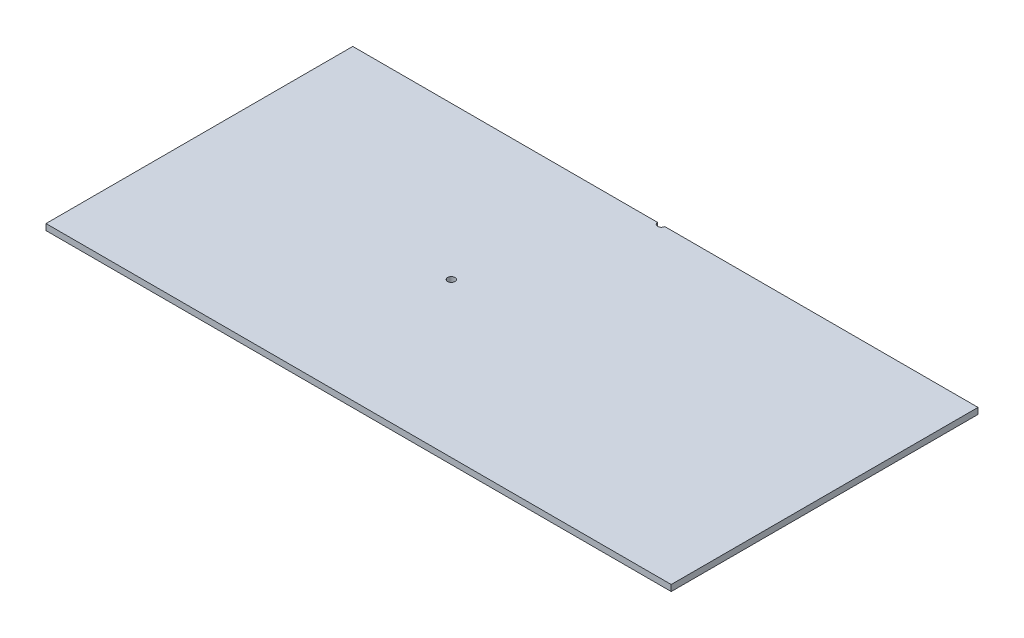
ISO-10303-21;
HEADER;
FILE_DESCRIPTION(('STEP AP214'),'2;1');
FILE_NAME('part.step','',(''),(''),'','','');
FILE_SCHEMA(('AUTOMOTIVE_DESIGN { 1 0 10303 214 1 1 1 1 }'));
ENDSEC;
DATA;
#1=APPLICATION_CONTEXT('core data for automotive mechanical design processes');
#2=APPLICATION_PROTOCOL_DEFINITION('international standard','automotive_design',2000,#1);
#3=PRODUCT_CONTEXT('',#1,'mechanical');
#4=PRODUCT('Part','Part','',(#3));
#5=PRODUCT_RELATED_PRODUCT_CATEGORY('part','',(#4));
#6=PRODUCT_DEFINITION_FORMATION('','',#4);
#7=PRODUCT_DEFINITION_CONTEXT('part definition',#1,'design');
#8=PRODUCT_DEFINITION('design','',#6,#7);
#9=PRODUCT_DEFINITION_SHAPE('','',#8);
#10=(LENGTH_UNIT() NAMED_UNIT(*) SI_UNIT(.MILLI.,.METRE.));
#11=(NAMED_UNIT(*) PLANE_ANGLE_UNIT() SI_UNIT($,.RADIAN.));
#12=(NAMED_UNIT(*) SI_UNIT($,.STERADIAN.) SOLID_ANGLE_UNIT());
#13=UNCERTAINTY_MEASURE_WITH_UNIT(LENGTH_MEASURE(1.E-05),#10,'distance_accuracy_value','');
#14=(GEOMETRIC_REPRESENTATION_CONTEXT(3) GLOBAL_UNCERTAINTY_ASSIGNED_CONTEXT((#13)) GLOBAL_UNIT_ASSIGNED_CONTEXT((#10,
#11,#12)) REPRESENTATION_CONTEXT('',''));
#15=CARTESIAN_POINT('',(0.,0.,0.));
#16=DIRECTION('',(0.,0.,1.));
#17=DIRECTION('',(1.,0.,0.));
#18=AXIS2_PLACEMENT_3D('',#15,#16,#17);
#19=CARTESIAN_POINT('',(-117.712500067131,2.54,-60.0611811366151));
#20=DIRECTION('',(0.,0.,1.));
#21=DIRECTION('',(1.,0.,0.));
#22=AXIS2_PLACEMENT_3D('',#19,#20,#21);
#23=PLANE('',#22);
#24=DIRECTION('',(-1.,0.,0.));
#25=VECTOR('',#24,1.);
#26=CARTESIAN_POINT('',(-117.712500067131,2.54,-60.0611811366151));
#27=LINE('',#26,#25);
#28=CARTESIAN_POINT('',(8.24230103203622,2.54,-60.0611811366151));
#29=VERTEX_POINT('',#28);
#30=CARTESIAN_POINT('',(-117.712500067131,2.54,-60.0611811366151));
#31=VERTEX_POINT('',#30);
#32=EDGE_CURVE('E55',#29,#31,#27,.T.);
#33=ORIENTED_EDGE('',*,*,#32,.F.);
#34=DIRECTION('',(0.,-1.,0.));
#35=VECTOR('',#34,1.);
#36=CARTESIAN_POINT('',(8.24230103203622,0.,-60.0611811366151));
#37=LINE('',#36,#35);
#38=CARTESIAN_POINT('',(8.24230103203621,0.,-60.0611811366151));
#39=VERTEX_POINT('',#38);
#40=EDGE_CURVE('E93',#29,#39,#37,.T.);
#41=ORIENTED_EDGE('',*,*,#40,.T.);
#42=DIRECTION('',(-1.,0.,0.));
#43=VECTOR('',#42,1.);
#44=CARTESIAN_POINT('',(-117.712500067131,0.,-60.0611811366151));
#45=LINE('',#44,#43);
#46=CARTESIAN_POINT('',(-117.712500067131,0.,-60.0611811366151));
#47=VERTEX_POINT('',#46);
#48=EDGE_CURVE('E77',#39,#47,#45,.T.);
#49=ORIENTED_EDGE('',*,*,#48,.T.);
#50=DIRECTION('',(0.,-1.,0.));
#51=VECTOR('',#50,1.);
#52=CARTESIAN_POINT('',(-117.712500067131,2.54,-60.0611811366151));
#53=LINE('',#52,#51);
#54=EDGE_CURVE('E113',#31,#47,#53,.T.);
#55=ORIENTED_EDGE('',*,*,#54,.F.);
#56=EDGE_LOOP('',(#33,#41,#49,#55));
#57=FACE_BOUND('',#56,.T.);
#58=ADVANCED_FACE('F30',(#57),#23,.F.);
#59=CARTESIAN_POINT('',(-117.712500067131,2.54,-60.0611811366151));
#60=DIRECTION('',(1.,0.,0.));
#61=DIRECTION('',(0.,0.,-1.));
#62=AXIS2_PLACEMENT_3D('',#59,#60,#61);
#63=PLANE('',#62);
#64=DIRECTION('',(0.,0.,1.));
#65=VECTOR('',#64,1.);
#66=CARTESIAN_POINT('',(-117.712500067131,0.,-60.0611811366151));
#67=LINE('',#66,#65);
#68=CARTESIAN_POINT('',(-117.712500067131,0.,66.7346457073501));
#69=VERTEX_POINT('',#68);
#70=EDGE_CURVE('E104',#47,#69,#67,.T.);
#71=ORIENTED_EDGE('',*,*,#70,.T.);
#72=DIRECTION('',(0.,-1.,0.));
#73=VECTOR('',#72,1.);
#74=CARTESIAN_POINT('',(-117.712500067131,2.54,66.7346457073501));
#75=LINE('',#74,#73);
#76=CARTESIAN_POINT('',(-117.712500067131,2.54,66.7346457073501));
#77=VERTEX_POINT('',#76);
#78=EDGE_CURVE('E11',#77,#69,#75,.T.);
#79=ORIENTED_EDGE('',*,*,#78,.F.);
#80=DIRECTION('',(0.,0.,1.));
#81=VECTOR('',#80,1.);
#82=CARTESIAN_POINT('',(-117.712500067131,2.54,-60.0611811366151));
#83=LINE('',#82,#81);
#84=EDGE_CURVE('E108',#31,#77,#83,.T.);
#85=ORIENTED_EDGE('',*,*,#84,.F.);
#86=ORIENTED_EDGE('',*,*,#54,.T.);
#87=EDGE_LOOP('',(#71,#79,#85,#86));
#88=FACE_BOUND('',#87,.T.);
#89=ADVANCED_FACE('F32',(#88),#63,.F.);
#90=CARTESIAN_POINT('',(-117.712500067131,2.54,66.7346457073501));
#91=DIRECTION('',(0.,0.,-1.));
#92=DIRECTION('',(-1.,0.,0.));
#93=AXIS2_PLACEMENT_3D('',#90,#91,#92);
#94=PLANE('',#93);
#95=DIRECTION('',(1.,0.,0.));
#96=VECTOR('',#95,1.);
#97=CARTESIAN_POINT('',(-117.712500067131,0.,66.7346457073501));
#98=LINE('',#97,#96);
#99=CARTESIAN_POINT('',(140.698878032996,0.,66.7346457073501));
#100=VERTEX_POINT('',#99);
#101=EDGE_CURVE('E109',#69,#100,#98,.T.);
#102=ORIENTED_EDGE('',*,*,#101,.T.);
#103=DIRECTION('',(0.,-1.,0.));
#104=VECTOR('',#103,1.);
#105=CARTESIAN_POINT('',(140.698878032996,2.54,66.7346457073501));
#106=LINE('',#105,#104);
#107=CARTESIAN_POINT('',(140.698878032996,2.54,66.7346457073501));
#108=VERTEX_POINT('',#107);
#109=EDGE_CURVE('E39',#108,#100,#106,.T.);
#110=ORIENTED_EDGE('',*,*,#109,.F.);
#111=DIRECTION('',(1.,0.,0.));
#112=VECTOR('',#111,1.);
#113=CARTESIAN_POINT('',(-117.712500067131,2.54,66.7346457073501));
#114=LINE('',#113,#112);
#115=EDGE_CURVE('E84',#77,#108,#114,.T.);
#116=ORIENTED_EDGE('',*,*,#115,.F.);
#117=ORIENTED_EDGE('',*,*,#78,.T.);
#118=EDGE_LOOP('',(#102,#110,#116,#117));
#119=FACE_BOUND('',#118,.T.);
#120=ADVANCED_FACE('F134',(#119),#94,.F.);
#121=CARTESIAN_POINT('',(140.698878032996,2.54,-60.0611811366151));
#122=DIRECTION('',(-1.,0.,0.));
#123=DIRECTION('',(0.,0.,1.));
#124=AXIS2_PLACEMENT_3D('',#121,#122,#123);
#125=PLANE('',#124);
#126=DIRECTION('',(0.,0.,-1.));
#127=VECTOR('',#126,1.);
#128=CARTESIAN_POINT('',(140.698878032996,0.,-60.0611811366151));
#129=LINE('',#128,#127);
#130=CARTESIAN_POINT('',(140.698878032996,0.,-60.0611811366151));
#131=VERTEX_POINT('',#130);
#132=EDGE_CURVE('E106',#100,#131,#129,.T.);
#133=ORIENTED_EDGE('',*,*,#132,.T.);
#134=DIRECTION('',(0.,-1.,0.));
#135=VECTOR('',#134,1.);
#136=CARTESIAN_POINT('',(140.698878032996,2.54,-60.0611811366151));
#137=LINE('',#136,#135);
#138=CARTESIAN_POINT('',(140.698878032996,2.54,-60.0611811366151));
#139=VERTEX_POINT('',#138);
#140=EDGE_CURVE('E115',#139,#131,#137,.T.);
#141=ORIENTED_EDGE('',*,*,#140,.F.);
#142=DIRECTION('',(0.,0.,-1.));
#143=VECTOR('',#142,1.);
#144=CARTESIAN_POINT('',(140.698878032996,2.54,-60.0611811366151));
#145=LINE('',#144,#143);
#146=EDGE_CURVE('E125',#108,#139,#145,.T.);
#147=ORIENTED_EDGE('',*,*,#146,.F.);
#148=ORIENTED_EDGE('',*,*,#109,.T.);
#149=EDGE_LOOP('',(#133,#141,#147,#148));
#150=FACE_BOUND('',#149,.T.);
#151=ADVANCED_FACE('F123',(#150),#125,.F.);
#152=CARTESIAN_POINT('',(11.2385970441701,0.,-60.0611811366151));
#153=VERTEX_POINT('',#152);
#154=EDGE_CURVE('E105',#131,#153,#45,.T.);
#155=ORIENTED_EDGE('',*,*,#154,.T.);
#156=DIRECTION('',(0.,-1.,0.));
#157=VECTOR('',#156,1.);
#158=CARTESIAN_POINT('',(11.2385970441701,0.,-60.0611811366151));
#159=LINE('',#158,#157);
#160=CARTESIAN_POINT('',(11.2385970441701,2.54,-60.0611811366151));
#161=VERTEX_POINT('',#160);
#162=EDGE_CURVE('E46',#153,#161,#159,.F.);
#163=ORIENTED_EDGE('',*,*,#162,.T.);
#164=EDGE_CURVE('E116',#139,#161,#27,.T.);
#165=ORIENTED_EDGE('',*,*,#164,.F.);
#166=ORIENTED_EDGE('',*,*,#140,.T.);
#167=EDGE_LOOP('',(#155,#163,#165,#166));
#168=FACE_BOUND('',#167,.T.);
#169=ADVANCED_FACE('F127',(#168),#23,.F.);
#170=CARTESIAN_POINT('',(-117.712500067131,2.54,66.7346457073501));
#171=DIRECTION('',(0.,1.,0.));
#172=DIRECTION('',(0.,0.,1.));
#173=AXIS2_PLACEMENT_3D('',#170,#171,#172);
#174=PLANE('',#173);
#175=CARTESIAN_POINT('',(9.74044903810314,2.54,-60.1356965841253));
#176=DIRECTION('',(0.,1.,0.));
#177=DIRECTION('',(0.,0.,1.));
#178=AXIS2_PLACEMENT_3D('',#175,#176,#177);
#179=CIRCLE('',#178,1.49999999999999);
#180=EDGE_CURVE('E97',#29,#161,#179,.T.);
#181=ORIENTED_EDGE('',*,*,#180,.F.);
#182=ORIENTED_EDGE('',*,*,#32,.T.);
#183=ORIENTED_EDGE('',*,*,#84,.T.);
#184=ORIENTED_EDGE('',*,*,#115,.T.);
#185=ORIENTED_EDGE('',*,*,#146,.T.);
#186=ORIENTED_EDGE('',*,*,#164,.T.);
#187=EDGE_LOOP('',(#181,#182,#183,#184,#185,#186));
#188=FACE_BOUND('',#187,.T.);
#189=CARTESIAN_POINT('',(-13.9247202881482,2.54,3.0107866421065));
#190=DIRECTION('',(0.,1.,0.));
#191=DIRECTION('',(0.,0.,1.));
#192=AXIS2_PLACEMENT_3D('',#189,#190,#191);
#193=CIRCLE('',#192,1.49999999999999);
#194=CARTESIAN_POINT('',(-13.9247202881482,2.54,4.51078664210649));
#195=VERTEX_POINT('',#194);
#196=EDGE_CURVE('E99',#195,#195,#193,.T.);
#197=ORIENTED_EDGE('',*,*,#196,.F.);
#198=EDGE_LOOP('',(#197));
#199=FACE_BOUND('',#198,.T.);
#200=ADVANCED_FACE('F143',(#188,#199),#174,.T.);
#201=CARTESIAN_POINT('',(-117.712500067131,0.,66.7346457073501));
#202=DIRECTION('',(0.,1.,0.));
#203=DIRECTION('',(0.,0.,1.));
#204=AXIS2_PLACEMENT_3D('',#201,#202,#203);
#205=PLANE('',#204);
#206=CARTESIAN_POINT('',(-13.9247202881482,0.,3.0107866421065));
#207=DIRECTION('',(0.,1.,0.));
#208=DIRECTION('',(0.,0.,1.));
#209=AXIS2_PLACEMENT_3D('',#206,#207,#208);
#210=CIRCLE('',#209,1.49999999999999);
#211=CARTESIAN_POINT('',(-13.9247202881482,0.,4.51078664210649));
#212=VERTEX_POINT('',#211);
#213=EDGE_CURVE('E34',#212,#212,#210,.T.);
#214=ORIENTED_EDGE('',*,*,#213,.T.);
#215=EDGE_LOOP('',(#214));
#216=FACE_BOUND('',#215,.T.);
#217=ORIENTED_EDGE('',*,*,#48,.F.);
#218=CARTESIAN_POINT('',(9.74044903810314,0.,-60.1356965841253));
#219=DIRECTION('',(0.,-1.,0.));
#220=DIRECTION('',(0.,0.,-1.));
#221=AXIS2_PLACEMENT_3D('',#218,#219,#220);
#222=CIRCLE('',#221,1.49999999999999);
#223=EDGE_CURVE('E91',#153,#39,#222,.T.);
#224=ORIENTED_EDGE('',*,*,#223,.F.);
#225=ORIENTED_EDGE('',*,*,#154,.F.);
#226=ORIENTED_EDGE('',*,*,#132,.F.);
#227=ORIENTED_EDGE('',*,*,#101,.F.);
#228=ORIENTED_EDGE('',*,*,#70,.F.);
#229=EDGE_LOOP('',(#217,#224,#225,#226,#227,#228));
#230=FACE_BOUND('',#229,.T.);
#231=ADVANCED_FACE('F102',(#216,#230),#205,.F.);
#232=CARTESIAN_POINT('',(-13.9247202881482,2.54,3.0107866421065));
#233=DIRECTION('',(0.,1.,0.));
#234=DIRECTION('',(0.,0.,1.));
#235=AXIS2_PLACEMENT_3D('',#232,#233,#234);
#236=CYLINDRICAL_SURFACE('',#235,1.49999999999999);
#237=ORIENTED_EDGE('',*,*,#196,.T.);
#238=EDGE_LOOP('',(#237));
#239=FACE_BOUND('',#238,.T.);
#240=ORIENTED_EDGE('',*,*,#213,.F.);
#241=EDGE_LOOP('',(#240));
#242=FACE_BOUND('',#241,.T.);
#243=ADVANCED_FACE('F149',(#239,#242),#236,.F.);
#244=CARTESIAN_POINT('',(9.74044903810314,0.,-60.1356965841253));
#245=DIRECTION('',(0.,-1.,0.));
#246=DIRECTION('',(0.,0.,-1.));
#247=AXIS2_PLACEMENT_3D('',#244,#245,#246);
#248=CYLINDRICAL_SURFACE('',#247,1.49999999999999);
#249=ORIENTED_EDGE('',*,*,#180,.T.);
#250=ORIENTED_EDGE('',*,*,#162,.F.);
#251=ORIENTED_EDGE('',*,*,#223,.T.);
#252=ORIENTED_EDGE('',*,*,#40,.F.);
#253=EDGE_LOOP('',(#249,#250,#251,#252));
#254=FACE_BOUND('',#253,.T.);
#255=ADVANCED_FACE('F92',(#254),#248,.F.);
#256=CLOSED_SHELL('',(#58,#89,#120,#151,#169,#200,#231,#243,#255));
#257=MANIFOLD_SOLID_BREP('B2',#256);
#258=ADVANCED_BREP_SHAPE_REPRESENTATION('',(#18,#257),#14);
#259=SHAPE_DEFINITION_REPRESENTATION(#9,#258);
ENDSEC;
END-ISO-10303-21;
